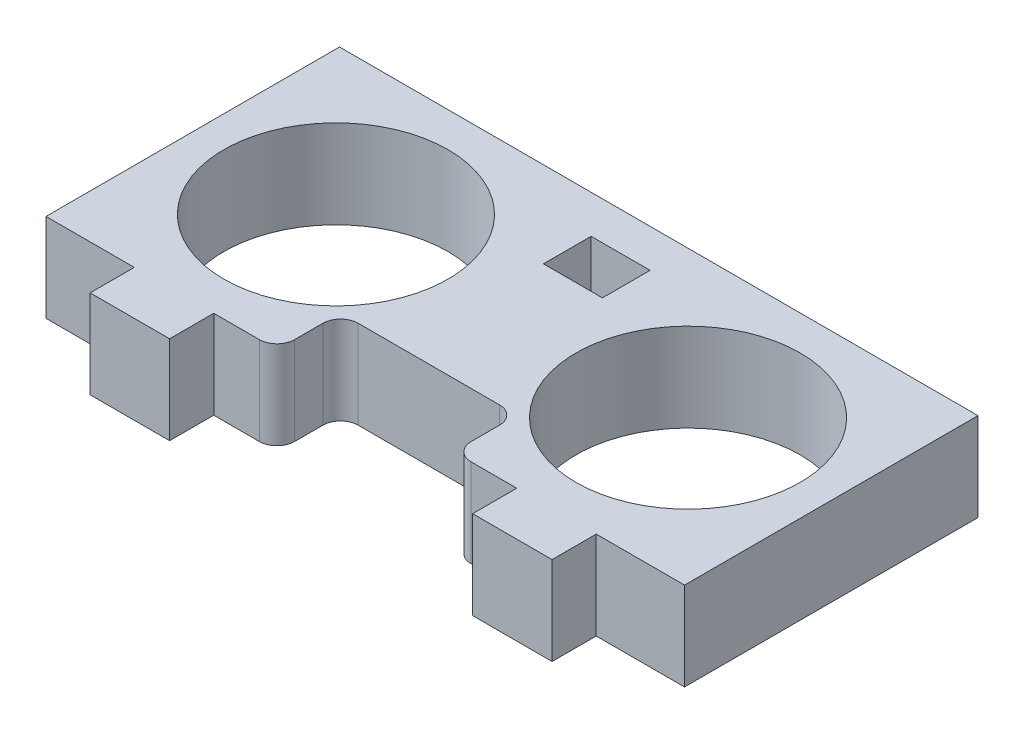
ISO-10303-21;
HEADER;
FILE_DESCRIPTION(('STEP AP214'),'2;1');
FILE_NAME('part.step','',(''),(''),'','','');
FILE_SCHEMA(('AUTOMOTIVE_DESIGN { 1 0 10303 214 1 1 1 1 }'));
ENDSEC;
DATA;
#1=APPLICATION_CONTEXT('core data for automotive mechanical design processes');
#2=APPLICATION_PROTOCOL_DEFINITION('international standard','automotive_design',2000,#1);
#3=PRODUCT_CONTEXT('',#1,'mechanical');
#4=PRODUCT('Part','Part','',(#3));
#5=PRODUCT_RELATED_PRODUCT_CATEGORY('part','',(#4));
#6=PRODUCT_DEFINITION_FORMATION('','',#4);
#7=PRODUCT_DEFINITION_CONTEXT('part definition',#1,'design');
#8=PRODUCT_DEFINITION('design','',#6,#7);
#9=PRODUCT_DEFINITION_SHAPE('','',#8);
#10=(LENGTH_UNIT() NAMED_UNIT(*) SI_UNIT(.MILLI.,.METRE.));
#11=(NAMED_UNIT(*) PLANE_ANGLE_UNIT() SI_UNIT($,.RADIAN.));
#12=(NAMED_UNIT(*) SI_UNIT($,.STERADIAN.) SOLID_ANGLE_UNIT());
#13=UNCERTAINTY_MEASURE_WITH_UNIT(LENGTH_MEASURE(1.E-05),#10,'distance_accuracy_value','');
#14=(GEOMETRIC_REPRESENTATION_CONTEXT(3) GLOBAL_UNCERTAINTY_ASSIGNED_CONTEXT((#13)) GLOBAL_UNIT_ASSIGNED_CONTEXT((#10,
#11,#12)) REPRESENTATION_CONTEXT('',''));
#15=CARTESIAN_POINT('',(0.,0.,0.));
#16=DIRECTION('',(0.,0.,1.));
#17=DIRECTION('',(1.,0.,0.));
#18=AXIS2_PLACEMENT_3D('',#15,#16,#17);
#19=CARTESIAN_POINT('',(-22.9616,6.35,10.5537));
#20=DIRECTION('',(0.,0.,-1.));
#21=DIRECTION('',(-1.,0.,0.));
#22=AXIS2_PLACEMENT_3D('',#19,#20,#21);
#23=PLANE('',#22);
#24=DIRECTION('',(1.,0.,0.));
#25=VECTOR('',#24,1.);
#26=CARTESIAN_POINT('',(-22.9616,6.35,10.5537));
#27=LINE('',#26,#25);
#28=CARTESIAN_POINT('',(7.61999999999999,6.35,10.5537));
#29=VERTEX_POINT('',#28);
#30=CARTESIAN_POINT('',(10.8966,6.35,10.5537));
#31=VERTEX_POINT('',#30);
#32=EDGE_CURVE('E220',#29,#31,#27,.T.);
#33=ORIENTED_EDGE('',*,*,#32,.F.);
#34=DIRECTION('',(0.,1.,0.));
#35=VECTOR('',#34,1.);
#36=CARTESIAN_POINT('',(7.62,6.35,10.5537));
#37=LINE('',#36,#35);
#38=CARTESIAN_POINT('',(7.61999999999999,0.,10.5537));
#39=VERTEX_POINT('',#38);
#40=EDGE_CURVE('E364',#29,#39,#37,.F.);
#41=ORIENTED_EDGE('',*,*,#40,.T.);
#42=DIRECTION('',(1.,0.,0.));
#43=VECTOR('',#42,1.);
#44=CARTESIAN_POINT('',(-22.9616,0.,10.5537));
#45=LINE('',#44,#43);
#46=CARTESIAN_POINT('',(10.8966,0.,10.5537));
#47=VERTEX_POINT('',#46);
#48=EDGE_CURVE('E343',#39,#47,#45,.T.);
#49=ORIENTED_EDGE('',*,*,#48,.T.);
#50=DIRECTION('',(0.,1.,0.));
#51=VECTOR('',#50,1.);
#52=CARTESIAN_POINT('',(10.8966,-6.53772513952675,10.5537));
#53=LINE('',#52,#51);
#54=EDGE_CURVE('E227',#47,#31,#53,.T.);
#55=ORIENTED_EDGE('',*,*,#54,.T.);
#56=EDGE_LOOP('',(#33,#41,#49,#55));
#57=FACE_BOUND('',#56,.T.);
#58=ADVANCED_FACE('F33',(#57),#23,.F.);
#59=CARTESIAN_POINT('',(-22.9616,0.,10.5537));
#60=VERTEX_POINT('',#59);
#61=CARTESIAN_POINT('',(-16.6116,0.,10.5537));
#62=VERTEX_POINT('',#61);
#63=EDGE_CURVE('E324',#60,#62,#45,.T.);
#64=ORIENTED_EDGE('',*,*,#63,.T.);
#65=DIRECTION('',(0.,1.,0.));
#66=VECTOR('',#65,1.);
#67=CARTESIAN_POINT('',(-16.6116,-6.53772513952675,10.5537));
#68=LINE('',#67,#66);
#69=CARTESIAN_POINT('',(-16.6116,6.35,10.5537));
#70=VERTEX_POINT('',#69);
#71=EDGE_CURVE('E240',#62,#70,#68,.T.);
#72=ORIENTED_EDGE('',*,*,#71,.T.);
#73=CARTESIAN_POINT('',(-22.9616,6.35,10.5537));
#74=VERTEX_POINT('',#73);
#75=EDGE_CURVE('E329',#74,#70,#27,.T.);
#76=ORIENTED_EDGE('',*,*,#75,.F.);
#77=DIRECTION('',(0.,-1.,0.));
#78=VECTOR('',#77,1.);
#79=CARTESIAN_POINT('',(-22.9616,6.35,10.5537));
#80=LINE('',#79,#78);
#81=EDGE_CURVE('E346',#74,#60,#80,.T.);
#82=ORIENTED_EDGE('',*,*,#81,.T.);
#83=EDGE_LOOP('',(#64,#72,#76,#82));
#84=FACE_BOUND('',#83,.T.);
#85=ADVANCED_FACE('F447',(#84),#23,.F.);
#86=CARTESIAN_POINT('',(-10.8966,0.,10.5537));
#87=VERTEX_POINT('',#86);
#88=CARTESIAN_POINT('',(-7.62,0.,10.5537));
#89=VERTEX_POINT('',#88);
#90=EDGE_CURVE('E342',#87,#89,#45,.T.);
#91=ORIENTED_EDGE('',*,*,#90,.T.);
#92=DIRECTION('',(0.,1.,0.));
#93=VECTOR('',#92,1.);
#94=CARTESIAN_POINT('',(-7.62,6.35,10.5537));
#95=LINE('',#94,#93);
#96=CARTESIAN_POINT('',(-7.62,6.35,10.5537));
#97=VERTEX_POINT('',#96);
#98=EDGE_CURVE('E369',#89,#97,#95,.T.);
#99=ORIENTED_EDGE('',*,*,#98,.T.);
#100=CARTESIAN_POINT('',(-10.8966,6.35,10.5537));
#101=VERTEX_POINT('',#100);
#102=EDGE_CURVE('E333',#101,#97,#27,.T.);
#103=ORIENTED_EDGE('',*,*,#102,.F.);
#104=DIRECTION('',(0.,1.,0.));
#105=VECTOR('',#104,1.);
#106=CARTESIAN_POINT('',(-10.8966,-6.53772513952675,10.5537));
#107=LINE('',#106,#105);
#108=EDGE_CURVE('E254',#87,#101,#107,.T.);
#109=ORIENTED_EDGE('',*,*,#108,.F.);
#110=EDGE_LOOP('',(#91,#99,#103,#109));
#111=FACE_BOUND('',#110,.T.);
#112=ADVANCED_FACE('F411',(#111),#23,.F.);
#113=CARTESIAN_POINT('',(0.,6.35,0.));
#114=DIRECTION('',(0.,1.,0.));
#115=DIRECTION('',(0.,0.,1.));
#116=AXIS2_PLACEMENT_3D('',#113,#114,#115);
#117=PLANE('',#116);
#118=DIRECTION('',(0.,0.,-1.));
#119=VECTOR('',#118,1.);
#120=CARTESIAN_POINT('',(6.35,6.35,10.5537));
#121=LINE('',#120,#119);
#122=CARTESIAN_POINT('',(6.35,6.35,9.28369999999999));
#123=VERTEX_POINT('',#122);
#124=CARTESIAN_POINT('',(6.35,6.35,7.25169999999999));
#125=VERTEX_POINT('',#124);
#126=EDGE_CURVE('E274',#123,#125,#121,.T.);
#127=ORIENTED_EDGE('',*,*,#126,.F.);
#128=CARTESIAN_POINT('',(7.62,6.35,9.28369999999999));
#129=DIRECTION('',(0.,1.,0.));
#130=DIRECTION('',(0.,0.,1.));
#131=AXIS2_PLACEMENT_3D('',#128,#129,#130);
#132=CIRCLE('',#131,1.27);
#133=EDGE_CURVE('E362',#123,#29,#132,.T.);
#134=ORIENTED_EDGE('',*,*,#133,.T.);
#135=ORIENTED_EDGE('',*,*,#32,.T.);
#136=DIRECTION('',(0.,0.,1.));
#137=VECTOR('',#136,1.);
#138=CARTESIAN_POINT('',(10.8966,6.35,10.5537));
#139=LINE('',#138,#137);
#140=CARTESIAN_POINT('',(10.8966,6.35,13.7287));
#141=VERTEX_POINT('',#140);
#142=EDGE_CURVE('E200',#31,#141,#139,.T.);
#143=ORIENTED_EDGE('',*,*,#142,.T.);
#144=DIRECTION('',(1.,0.,0.));
#145=VECTOR('',#144,1.);
#146=CARTESIAN_POINT('',(10.8966,6.35,13.7287));
#147=LINE('',#146,#145);
#148=CARTESIAN_POINT('',(16.6116,6.35,13.7287));
#149=VERTEX_POINT('',#148);
#150=EDGE_CURVE('E209',#141,#149,#147,.T.);
#151=ORIENTED_EDGE('',*,*,#150,.T.);
#152=DIRECTION('',(0.,0.,-1.));
#153=VECTOR('',#152,1.);
#154=CARTESIAN_POINT('',(16.6116,6.35,10.5537));
#155=LINE('',#154,#153);
#156=CARTESIAN_POINT('',(16.6116,6.35,10.5537));
#157=VERTEX_POINT('',#156);
#158=EDGE_CURVE('E206',#149,#157,#155,.T.);
#159=ORIENTED_EDGE('',*,*,#158,.T.);
#160=CARTESIAN_POINT('',(22.9616,6.35,10.5537));
#161=VERTEX_POINT('',#160);
#162=EDGE_CURVE('E328',#157,#161,#27,.T.);
#163=ORIENTED_EDGE('',*,*,#162,.T.);
#164=DIRECTION('',(0.,0.,-1.));
#165=VECTOR('',#164,1.);
#166=CARTESIAN_POINT('',(22.9616,6.35,-10.5537));
#167=LINE('',#166,#165);
#168=CARTESIAN_POINT('',(22.9616,6.35,-10.5537));
#169=VERTEX_POINT('',#168);
#170=EDGE_CURVE('E320',#161,#169,#167,.T.);
#171=ORIENTED_EDGE('',*,*,#170,.T.);
#172=DIRECTION('',(-1.,0.,0.));
#173=VECTOR('',#172,1.);
#174=CARTESIAN_POINT('',(-22.9616,6.35,-10.5537));
#175=LINE('',#174,#173);
#176=CARTESIAN_POINT('',(-22.9616,6.35,-10.5537));
#177=VERTEX_POINT('',#176);
#178=EDGE_CURVE('E323',#169,#177,#175,.T.);
#179=ORIENTED_EDGE('',*,*,#178,.T.);
#180=DIRECTION('',(0.,0.,1.));
#181=VECTOR('',#180,1.);
#182=CARTESIAN_POINT('',(-22.9616,6.35,-10.5537));
#183=LINE('',#182,#181);
#184=EDGE_CURVE('E326',#177,#74,#183,.T.);
#185=ORIENTED_EDGE('',*,*,#184,.T.);
#186=ORIENTED_EDGE('',*,*,#75,.T.);
#187=DIRECTION('',(0.,0.,1.));
#188=VECTOR('',#187,1.);
#189=CARTESIAN_POINT('',(-16.6116,6.35,10.5537));
#190=LINE('',#189,#188);
#191=CARTESIAN_POINT('',(-16.6116,6.35,13.7287));
#192=VERTEX_POINT('',#191);
#193=EDGE_CURVE('E236',#70,#192,#190,.T.);
#194=ORIENTED_EDGE('',*,*,#193,.T.);
#195=DIRECTION('',(1.,0.,0.));
#196=VECTOR('',#195,1.);
#197=CARTESIAN_POINT('',(-16.6116,6.35,13.7287));
#198=LINE('',#197,#196);
#199=CARTESIAN_POINT('',(-10.8966,6.35,13.7287));
#200=VERTEX_POINT('',#199);
#201=EDGE_CURVE('E246',#192,#200,#198,.T.);
#202=ORIENTED_EDGE('',*,*,#201,.T.);
#203=DIRECTION('',(0.,0.,-1.));
#204=VECTOR('',#203,1.);
#205=CARTESIAN_POINT('',(-10.8966,6.35,10.5537));
#206=LINE('',#205,#204);
#207=EDGE_CURVE('E249',#200,#101,#206,.T.);
#208=ORIENTED_EDGE('',*,*,#207,.T.);
#209=ORIENTED_EDGE('',*,*,#102,.T.);
#210=CARTESIAN_POINT('',(-7.62,6.35,9.28369999999999));
#211=DIRECTION('',(0.,1.,0.));
#212=DIRECTION('',(0.,0.,1.));
#213=AXIS2_PLACEMENT_3D('',#210,#211,#212);
#214=CIRCLE('',#213,1.27);
#215=CARTESIAN_POINT('',(-6.35,6.35,9.28369999999999));
#216=VERTEX_POINT('',#215);
#217=EDGE_CURVE('E360',#97,#216,#214,.T.);
#218=ORIENTED_EDGE('',*,*,#217,.T.);
#219=DIRECTION('',(0.,0.,1.));
#220=VECTOR('',#219,1.);
#221=CARTESIAN_POINT('',(-6.35,6.35,10.5537));
#222=LINE('',#221,#220);
#223=CARTESIAN_POINT('',(-6.35,6.35,7.25169999999999));
#224=VERTEX_POINT('',#223);
#225=EDGE_CURVE('E261',#224,#216,#222,.T.);
#226=ORIENTED_EDGE('',*,*,#225,.F.);
#227=CARTESIAN_POINT('',(-5.08,6.35,7.25169999999999));
#228=DIRECTION('',(0.,1.,0.));
#229=DIRECTION('',(0.,0.,1.));
#230=AXIS2_PLACEMENT_3D('',#227,#228,#229);
#231=CIRCLE('',#230,1.27);
#232=CARTESIAN_POINT('',(-5.08,6.35,5.98169999999999));
#233=VERTEX_POINT('',#232);
#234=EDGE_CURVE('E382',#224,#233,#231,.F.);
#235=ORIENTED_EDGE('',*,*,#234,.T.);
#236=DIRECTION('',(-1.,0.,0.));
#237=VECTOR('',#236,1.);
#238=CARTESIAN_POINT('',(-6.35,6.35,5.98169999999999));
#239=LINE('',#238,#237);
#240=CARTESIAN_POINT('',(5.08,6.35,5.98169999999999));
#241=VERTEX_POINT('',#240);
#242=EDGE_CURVE('E266',#241,#233,#239,.T.);
#243=ORIENTED_EDGE('',*,*,#242,.F.);
#244=CARTESIAN_POINT('',(5.08,6.35,7.25169999999999));
#245=DIRECTION('',(0.,1.,0.));
#246=DIRECTION('',(0.,0.,1.));
#247=AXIS2_PLACEMENT_3D('',#244,#245,#246);
#248=CIRCLE('',#247,1.27);
#249=EDGE_CURVE('E41',#241,#125,#248,.F.);
#250=ORIENTED_EDGE('',*,*,#249,.T.);
#251=EDGE_LOOP('',(#127,#134,#135,#143,#151,#159,#163,#171,#179,#185,#186,#194,#202,#208,#209,
#218,#226,#235,#243,#250));
#252=FACE_BOUND('',#251,.T.);
#253=DIRECTION('',(0.,0.,-1.));
#254=VECTOR('',#253,1.);
#255=CARTESIAN_POINT('',(2.1209,6.35,-7.8105));
#256=LINE('',#255,#254);
#257=CARTESIAN_POINT('',(2.1209,6.35,-4.38150000000001));
#258=VERTEX_POINT('',#257);
#259=CARTESIAN_POINT('',(2.1209,6.35,-7.8105));
#260=VERTEX_POINT('',#259);
#261=EDGE_CURVE('E271',#258,#260,#256,.T.);
#262=ORIENTED_EDGE('',*,*,#261,.F.);
#263=DIRECTION('',(1.,0.,0.));
#264=VECTOR('',#263,1.);
#265=CARTESIAN_POINT('',(-2.1209,6.35,-4.38150000000001));
#266=LINE('',#265,#264);
#267=CARTESIAN_POINT('',(-2.1209,6.35,-4.38150000000001));
#268=VERTEX_POINT('',#267);
#269=EDGE_CURVE('E295',#268,#258,#266,.T.);
#270=ORIENTED_EDGE('',*,*,#269,.F.);
#271=DIRECTION('',(0.,0.,1.));
#272=VECTOR('',#271,1.);
#273=CARTESIAN_POINT('',(-2.1209,6.35,-7.8105));
#274=LINE('',#273,#272);
#275=CARTESIAN_POINT('',(-2.1209,6.35,-7.8105));
#276=VERTEX_POINT('',#275);
#277=EDGE_CURVE('E292',#276,#268,#274,.T.);
#278=ORIENTED_EDGE('',*,*,#277,.F.);
#279=DIRECTION('',(-1.,0.,0.));
#280=VECTOR('',#279,1.);
#281=CARTESIAN_POINT('',(-2.1209,6.35,-7.8105));
#282=LINE('',#281,#280);
#283=EDGE_CURVE('E289',#260,#276,#282,.T.);
#284=ORIENTED_EDGE('',*,*,#283,.F.);
#285=EDGE_LOOP('',(#262,#270,#278,#284));
#286=FACE_BOUND('',#285,.T.);
#287=CARTESIAN_POINT('',(-12.6619,6.35,0.));
#288=DIRECTION('',(0.,1.,0.));
#289=DIRECTION('',(0.,0.,1.));
#290=AXIS2_PLACEMENT_3D('',#287,#288,#289);
#291=CIRCLE('',#290,8.0645);
#292=CARTESIAN_POINT('',(-12.6619,6.35,8.0645));
#293=VERTEX_POINT('',#292);
#294=EDGE_CURVE('E314',#293,#293,#291,.T.);
#295=ORIENTED_EDGE('',*,*,#294,.F.);
#296=EDGE_LOOP('',(#295));
#297=FACE_BOUND('',#296,.T.);
#298=CARTESIAN_POINT('',(12.6619,6.35,0.));
#299=DIRECTION('',(0.,1.,0.));
#300=DIRECTION('',(0.,0.,1.));
#301=AXIS2_PLACEMENT_3D('',#298,#299,#300);
#302=CIRCLE('',#301,8.0645);
#303=CARTESIAN_POINT('',(12.6619,6.35,8.0645));
#304=VERTEX_POINT('',#303);
#305=EDGE_CURVE('E308',#304,#304,#302,.T.);
#306=ORIENTED_EDGE('',*,*,#305,.F.);
#307=EDGE_LOOP('',(#306));
#308=FACE_BOUND('',#307,.T.);
#309=ADVANCED_FACE('F217',(#252,#286,#297,#308),#117,.T.);
#310=CARTESIAN_POINT('',(0.,0.,0.));
#311=DIRECTION('',(0.,1.,0.));
#312=DIRECTION('',(0.,0.,1.));
#313=AXIS2_PLACEMENT_3D('',#310,#311,#312);
#314=PLANE('',#313);
#315=DIRECTION('',(-1.,0.,0.));
#316=VECTOR('',#315,1.);
#317=CARTESIAN_POINT('',(-2.1209,0.,-4.38150000000001));
#318=LINE('',#317,#316);
#319=CARTESIAN_POINT('',(2.1209,0.,-4.38150000000001));
#320=VERTEX_POINT('',#319);
#321=CARTESIAN_POINT('',(-2.1209,0.,-4.38150000000001));
#322=VERTEX_POINT('',#321);
#323=EDGE_CURVE('E282',#320,#322,#318,.T.);
#324=ORIENTED_EDGE('',*,*,#323,.F.);
#325=DIRECTION('',(0.,0.,1.));
#326=VECTOR('',#325,1.);
#327=CARTESIAN_POINT('',(2.1209,0.,-7.8105));
#328=LINE('',#327,#326);
#329=CARTESIAN_POINT('',(2.1209,0.,-7.8105));
#330=VERTEX_POINT('',#329);
#331=EDGE_CURVE('E285',#330,#320,#328,.T.);
#332=ORIENTED_EDGE('',*,*,#331,.F.);
#333=DIRECTION('',(1.,0.,0.));
#334=VECTOR('',#333,1.);
#335=CARTESIAN_POINT('',(-2.1209,0.,-7.8105));
#336=LINE('',#335,#334);
#337=CARTESIAN_POINT('',(-2.1209,0.,-7.8105));
#338=VERTEX_POINT('',#337);
#339=EDGE_CURVE('E287',#338,#330,#336,.T.);
#340=ORIENTED_EDGE('',*,*,#339,.F.);
#341=DIRECTION('',(0.,0.,-1.));
#342=VECTOR('',#341,1.);
#343=CARTESIAN_POINT('',(-2.1209,0.,-7.8105));
#344=LINE('',#343,#342);
#345=EDGE_CURVE('E279',#322,#338,#344,.T.);
#346=ORIENTED_EDGE('',*,*,#345,.F.);
#347=EDGE_LOOP('',(#324,#332,#340,#346));
#348=FACE_BOUND('',#347,.T.);
#349=CARTESIAN_POINT('',(-12.6619,0.,0.));
#350=DIRECTION('',(0.,1.,0.));
#351=DIRECTION('',(0.,0.,1.));
#352=AXIS2_PLACEMENT_3D('',#349,#350,#351);
#353=CIRCLE('',#352,8.0645);
#354=CARTESIAN_POINT('',(-12.6619,0.,8.0645));
#355=VERTEX_POINT('',#354);
#356=EDGE_CURVE('E311',#355,#355,#353,.T.);
#357=ORIENTED_EDGE('',*,*,#356,.T.);
#358=EDGE_LOOP('',(#357));
#359=FACE_BOUND('',#358,.T.);
#360=ORIENTED_EDGE('',*,*,#48,.F.);
#361=CARTESIAN_POINT('',(7.62,0.,9.28369999999999));
#362=DIRECTION('',(0.,1.,0.));
#363=DIRECTION('',(0.,0.,1.));
#364=AXIS2_PLACEMENT_3D('',#361,#362,#363);
#365=CIRCLE('',#364,1.27);
#366=CARTESIAN_POINT('',(6.35,0.,9.28369999999999));
#367=VERTEX_POINT('',#366);
#368=EDGE_CURVE('E367',#39,#367,#365,.F.);
#369=ORIENTED_EDGE('',*,*,#368,.T.);
#370=DIRECTION('',(0.,0.,1.));
#371=VECTOR('',#370,1.);
#372=CARTESIAN_POINT('',(6.35,0.,10.5537));
#373=LINE('',#372,#371);
#374=CARTESIAN_POINT('',(6.35,0.,7.25169999999999));
#375=VERTEX_POINT('',#374);
#376=EDGE_CURVE('E262',#375,#367,#373,.T.);
#377=ORIENTED_EDGE('',*,*,#376,.F.);
#378=CARTESIAN_POINT('',(5.08,0.,7.25169999999999));
#379=DIRECTION('',(0.,1.,0.));
#380=DIRECTION('',(0.,0.,1.));
#381=AXIS2_PLACEMENT_3D('',#378,#379,#380);
#382=CIRCLE('',#381,1.27);
#383=CARTESIAN_POINT('',(5.08,0.,5.98169999999999));
#384=VERTEX_POINT('',#383);
#385=EDGE_CURVE('E11',#375,#384,#382,.T.);
#386=ORIENTED_EDGE('',*,*,#385,.T.);
#387=DIRECTION('',(1.,0.,0.));
#388=VECTOR('',#387,1.);
#389=CARTESIAN_POINT('',(-6.35,0.,5.98169999999999));
#390=LINE('',#389,#388);
#391=CARTESIAN_POINT('',(-5.08,0.,5.98169999999999));
#392=VERTEX_POINT('',#391);
#393=EDGE_CURVE('E265',#392,#384,#390,.T.);
#394=ORIENTED_EDGE('',*,*,#393,.F.);
#395=CARTESIAN_POINT('',(-5.08,0.,7.25169999999999));
#396=DIRECTION('',(0.,1.,0.));
#397=DIRECTION('',(0.,0.,1.));
#398=AXIS2_PLACEMENT_3D('',#395,#396,#397);
#399=CIRCLE('',#398,1.27);
#400=CARTESIAN_POINT('',(-6.35,0.,7.25169999999999));
#401=VERTEX_POINT('',#400);
#402=EDGE_CURVE('E54',#392,#401,#399,.T.);
#403=ORIENTED_EDGE('',*,*,#402,.T.);
#404=DIRECTION('',(0.,0.,-1.));
#405=VECTOR('',#404,1.);
#406=CARTESIAN_POINT('',(-6.35,0.,10.5537));
#407=LINE('',#406,#405);
#408=CARTESIAN_POINT('',(-6.35,0.,9.28369999999999));
#409=VERTEX_POINT('',#408);
#410=EDGE_CURVE('E269',#409,#401,#407,.T.);
#411=ORIENTED_EDGE('',*,*,#410,.F.);
#412=CARTESIAN_POINT('',(-7.62,0.,9.28369999999999));
#413=DIRECTION('',(0.,1.,0.));
#414=DIRECTION('',(0.,0.,1.));
#415=AXIS2_PLACEMENT_3D('',#412,#413,#414);
#416=CIRCLE('',#415,1.27);
#417=EDGE_CURVE('E48',#409,#89,#416,.F.);
#418=ORIENTED_EDGE('',*,*,#417,.T.);
#419=ORIENTED_EDGE('',*,*,#90,.F.);
#420=DIRECTION('',(0.,0.,1.));
#421=VECTOR('',#420,1.);
#422=CARTESIAN_POINT('',(-10.8966,0.,10.5537));
#423=LINE('',#422,#421);
#424=CARTESIAN_POINT('',(-10.8966,0.,13.7287));
#425=VERTEX_POINT('',#424);
#426=EDGE_CURVE('E237',#87,#425,#423,.T.);
#427=ORIENTED_EDGE('',*,*,#426,.T.);
#428=DIRECTION('',(-1.,0.,0.));
#429=VECTOR('',#428,1.);
#430=CARTESIAN_POINT('',(-16.6116,0.,13.7287));
#431=LINE('',#430,#429);
#432=CARTESIAN_POINT('',(-16.6116,0.,13.7287));
#433=VERTEX_POINT('',#432);
#434=EDGE_CURVE('E243',#425,#433,#431,.T.);
#435=ORIENTED_EDGE('',*,*,#434,.T.);
#436=DIRECTION('',(0.,0.,-1.));
#437=VECTOR('',#436,1.);
#438=CARTESIAN_POINT('',(-16.6116,0.,10.5537));
#439=LINE('',#438,#437);
#440=EDGE_CURVE('E239',#433,#62,#439,.T.);
#441=ORIENTED_EDGE('',*,*,#440,.T.);
#442=ORIENTED_EDGE('',*,*,#63,.F.);
#443=DIRECTION('',(0.,0.,1.));
#444=VECTOR('',#443,1.);
#445=CARTESIAN_POINT('',(-22.9616,0.,-10.5537));
#446=LINE('',#445,#444);
#447=CARTESIAN_POINT('',(-22.9616,0.,-10.5537));
#448=VERTEX_POINT('',#447);
#449=EDGE_CURVE('E338',#448,#60,#446,.T.);
#450=ORIENTED_EDGE('',*,*,#449,.F.);
#451=DIRECTION('',(-1.,0.,0.));
#452=VECTOR('',#451,1.);
#453=CARTESIAN_POINT('',(-22.9616,0.,-10.5537));
#454=LINE('',#453,#452);
#455=CARTESIAN_POINT('',(22.9616,0.,-10.5537));
#456=VERTEX_POINT('',#455);
#457=EDGE_CURVE('E336',#456,#448,#454,.T.);
#458=ORIENTED_EDGE('',*,*,#457,.F.);
#459=DIRECTION('',(0.,0.,-1.));
#460=VECTOR('',#459,1.);
#461=CARTESIAN_POINT('',(22.9616,0.,-10.5537));
#462=LINE('',#461,#460);
#463=CARTESIAN_POINT('',(22.9616,0.,10.5537));
#464=VERTEX_POINT('',#463);
#465=EDGE_CURVE('E317',#464,#456,#462,.T.);
#466=ORIENTED_EDGE('',*,*,#465,.F.);
#467=CARTESIAN_POINT('',(16.6116,0.,10.5537));
#468=VERTEX_POINT('',#467);
#469=EDGE_CURVE('E340',#468,#464,#45,.T.);
#470=ORIENTED_EDGE('',*,*,#469,.F.);
#471=DIRECTION('',(0.,0.,1.));
#472=VECTOR('',#471,1.);
#473=CARTESIAN_POINT('',(16.6116,0.,10.5537));
#474=LINE('',#473,#472);
#475=CARTESIAN_POINT('',(16.6116,0.,13.7287));
#476=VERTEX_POINT('',#475);
#477=EDGE_CURVE('E229',#468,#476,#474,.T.);
#478=ORIENTED_EDGE('',*,*,#477,.T.);
#479=DIRECTION('',(-1.,0.,0.));
#480=VECTOR('',#479,1.);
#481=CARTESIAN_POINT('',(10.8966,0.,13.7287));
#482=LINE('',#481,#480);
#483=CARTESIAN_POINT('',(10.8966,0.,13.7287));
#484=VERTEX_POINT('',#483);
#485=EDGE_CURVE('E234',#476,#484,#482,.T.);
#486=ORIENTED_EDGE('',*,*,#485,.T.);
#487=DIRECTION('',(0.,0.,-1.));
#488=VECTOR('',#487,1.);
#489=CARTESIAN_POINT('',(10.8966,0.,10.5537));
#490=LINE('',#489,#488);
#491=EDGE_CURVE('E202',#484,#47,#490,.T.);
#492=ORIENTED_EDGE('',*,*,#491,.T.);
#493=EDGE_LOOP('',(#360,#369,#377,#386,#394,#403,#411,#418,#419,#427,#435,#441,#442,#450,#458,
#466,#470,#478,#486,#492));
#494=FACE_BOUND('',#493,.T.);
#495=CARTESIAN_POINT('',(12.6619,0.,0.));
#496=DIRECTION('',(0.,1.,0.));
#497=DIRECTION('',(0.,0.,1.));
#498=AXIS2_PLACEMENT_3D('',#495,#496,#497);
#499=CIRCLE('',#498,8.0645);
#500=CARTESIAN_POINT('',(12.6619,0.,8.0645));
#501=VERTEX_POINT('',#500);
#502=EDGE_CURVE('E307',#501,#501,#499,.T.);
#503=ORIENTED_EDGE('',*,*,#502,.T.);
#504=EDGE_LOOP('',(#503));
#505=FACE_BOUND('',#504,.T.);
#506=ADVANCED_FACE('F394',(#348,#359,#494,#505),#314,.F.);
#507=CARTESIAN_POINT('',(22.9616,6.35,-10.5537));
#508=DIRECTION('',(-1.,0.,0.));
#509=DIRECTION('',(0.,0.,1.));
#510=AXIS2_PLACEMENT_3D('',#507,#508,#509);
#511=PLANE('',#510);
#512=ORIENTED_EDGE('',*,*,#465,.T.);
#513=DIRECTION('',(0.,-1.,0.));
#514=VECTOR('',#513,1.);
#515=CARTESIAN_POINT('',(22.9616,6.35,-10.5537));
#516=LINE('',#515,#514);
#517=EDGE_CURVE('E352',#169,#456,#516,.T.);
#518=ORIENTED_EDGE('',*,*,#517,.F.);
#519=ORIENTED_EDGE('',*,*,#170,.F.);
#520=DIRECTION('',(0.,-1.,0.));
#521=VECTOR('',#520,1.);
#522=CARTESIAN_POINT('',(22.9616,6.35,10.5537));
#523=LINE('',#522,#521);
#524=EDGE_CURVE('E332',#161,#464,#523,.T.);
#525=ORIENTED_EDGE('',*,*,#524,.T.);
#526=EDGE_LOOP('',(#512,#518,#519,#525));
#527=FACE_BOUND('',#526,.T.);
#528=ADVANCED_FACE('F422',(#527),#511,.F.);
#529=CARTESIAN_POINT('',(-22.9616,6.35,-10.5537));
#530=DIRECTION('',(0.,0.,1.));
#531=DIRECTION('',(1.,0.,0.));
#532=AXIS2_PLACEMENT_3D('',#529,#530,#531);
#533=PLANE('',#532);
#534=ORIENTED_EDGE('',*,*,#457,.T.);
#535=DIRECTION('',(0.,-1.,0.));
#536=VECTOR('',#535,1.);
#537=CARTESIAN_POINT('',(-22.9616,6.35,-10.5537));
#538=LINE('',#537,#536);
#539=EDGE_CURVE('E349',#177,#448,#538,.T.);
#540=ORIENTED_EDGE('',*,*,#539,.F.);
#541=ORIENTED_EDGE('',*,*,#178,.F.);
#542=ORIENTED_EDGE('',*,*,#517,.T.);
#543=EDGE_LOOP('',(#534,#540,#541,#542));
#544=FACE_BOUND('',#543,.T.);
#545=ADVANCED_FACE('F428',(#544),#533,.F.);
#546=CARTESIAN_POINT('',(-22.9616,6.35,-10.5537));
#547=DIRECTION('',(1.,0.,0.));
#548=DIRECTION('',(0.,0.,-1.));
#549=AXIS2_PLACEMENT_3D('',#546,#547,#548);
#550=PLANE('',#549);
#551=ORIENTED_EDGE('',*,*,#449,.T.);
#552=ORIENTED_EDGE('',*,*,#81,.F.);
#553=ORIENTED_EDGE('',*,*,#184,.F.);
#554=ORIENTED_EDGE('',*,*,#539,.T.);
#555=EDGE_LOOP('',(#551,#552,#553,#554));
#556=FACE_BOUND('',#555,.T.);
#557=ADVANCED_FACE('F457',(#556),#550,.F.);
#558=ORIENTED_EDGE('',*,*,#162,.F.);
#559=DIRECTION('',(0.,1.,0.));
#560=VECTOR('',#559,1.);
#561=CARTESIAN_POINT('',(16.6116,-6.53772513952675,10.5537));
#562=LINE('',#561,#560);
#563=EDGE_CURVE('E230',#468,#157,#562,.T.);
#564=ORIENTED_EDGE('',*,*,#563,.F.);
#565=ORIENTED_EDGE('',*,*,#469,.T.);
#566=ORIENTED_EDGE('',*,*,#524,.F.);
#567=EDGE_LOOP('',(#558,#564,#565,#566));
#568=FACE_BOUND('',#567,.T.);
#569=ADVANCED_FACE('F417',(#568),#23,.F.);
#570=CARTESIAN_POINT('',(-12.6619,6.35,0.));
#571=DIRECTION('',(0.,-1.,0.));
#572=DIRECTION('',(0.,0.,-1.));
#573=AXIS2_PLACEMENT_3D('',#570,#571,#572);
#574=CYLINDRICAL_SURFACE('',#573,8.0645);
#575=ORIENTED_EDGE('',*,*,#294,.T.);
#576=EDGE_LOOP('',(#575));
#577=FACE_BOUND('',#576,.T.);
#578=ORIENTED_EDGE('',*,*,#356,.F.);
#579=EDGE_LOOP('',(#578));
#580=FACE_BOUND('',#579,.T.);
#581=ADVANCED_FACE('F456',(#577,#580),#574,.F.);
#582=CARTESIAN_POINT('',(12.6619,6.35,0.));
#583=DIRECTION('',(0.,-1.,0.));
#584=DIRECTION('',(0.,0.,-1.));
#585=AXIS2_PLACEMENT_3D('',#582,#583,#584);
#586=CYLINDRICAL_SURFACE('',#585,8.0645);
#587=ORIENTED_EDGE('',*,*,#305,.T.);
#588=EDGE_LOOP('',(#587));
#589=FACE_BOUND('',#588,.T.);
#590=ORIENTED_EDGE('',*,*,#502,.F.);
#591=EDGE_LOOP('',(#590));
#592=FACE_BOUND('',#591,.T.);
#593=ADVANCED_FACE('F462',(#589,#592),#586,.F.);
#594=CARTESIAN_POINT('',(2.1209,-13.4978955396758,-7.8105));
#595=DIRECTION('',(1.,0.,0.));
#596=DIRECTION('',(0.,0.,-1.));
#597=AXIS2_PLACEMENT_3D('',#594,#595,#596);
#598=PLANE('',#597);
#599=ORIENTED_EDGE('',*,*,#331,.T.);
#600=DIRECTION('',(0.,1.,0.));
#601=VECTOR('',#600,1.);
#602=CARTESIAN_POINT('',(2.1209,-13.4978955396758,-4.38150000000001));
#603=LINE('',#602,#601);
#604=EDGE_CURVE('E283',#320,#258,#603,.T.);
#605=ORIENTED_EDGE('',*,*,#604,.T.);
#606=ORIENTED_EDGE('',*,*,#261,.T.);
#607=DIRECTION('',(0.,1.,0.));
#608=VECTOR('',#607,1.);
#609=CARTESIAN_POINT('',(2.1209,-13.4978955396758,-7.8105));
#610=LINE('',#609,#608);
#611=EDGE_CURVE('E298',#330,#260,#610,.T.);
#612=ORIENTED_EDGE('',*,*,#611,.F.);
#613=EDGE_LOOP('',(#599,#605,#606,#612));
#614=FACE_BOUND('',#613,.T.);
#615=ADVANCED_FACE('F478',(#614),#598,.F.);
#616=CARTESIAN_POINT('',(-2.1209,-13.4978955396758,-4.38150000000001));
#617=DIRECTION('',(0.,0.,1.));
#618=DIRECTION('',(1.,0.,0.));
#619=AXIS2_PLACEMENT_3D('',#616,#617,#618);
#620=PLANE('',#619);
#621=ORIENTED_EDGE('',*,*,#323,.T.);
#622=DIRECTION('',(0.,1.,0.));
#623=VECTOR('',#622,1.);
#624=CARTESIAN_POINT('',(-2.1209,-13.4978955396758,-4.38150000000001));
#625=LINE('',#624,#623);
#626=EDGE_CURVE('E300',#322,#268,#625,.T.);
#627=ORIENTED_EDGE('',*,*,#626,.T.);
#628=ORIENTED_EDGE('',*,*,#269,.T.);
#629=ORIENTED_EDGE('',*,*,#604,.F.);
#630=EDGE_LOOP('',(#621,#627,#628,#629));
#631=FACE_BOUND('',#630,.T.);
#632=ADVANCED_FACE('F482',(#631),#620,.F.);
#633=CARTESIAN_POINT('',(-2.1209,-13.4978955396758,-7.8105));
#634=DIRECTION('',(-1.,0.,0.));
#635=DIRECTION('',(0.,0.,1.));
#636=AXIS2_PLACEMENT_3D('',#633,#634,#635);
#637=PLANE('',#636);
#638=ORIENTED_EDGE('',*,*,#345,.T.);
#639=DIRECTION('',(0.,1.,0.));
#640=VECTOR('',#639,1.);
#641=CARTESIAN_POINT('',(-2.1209,-13.4978955396758,-7.8105));
#642=LINE('',#641,#640);
#643=EDGE_CURVE('E302',#338,#276,#642,.T.);
#644=ORIENTED_EDGE('',*,*,#643,.T.);
#645=ORIENTED_EDGE('',*,*,#277,.T.);
#646=ORIENTED_EDGE('',*,*,#626,.F.);
#647=EDGE_LOOP('',(#638,#644,#645,#646));
#648=FACE_BOUND('',#647,.T.);
#649=ADVANCED_FACE('F487',(#648),#637,.F.);
#650=CARTESIAN_POINT('',(-2.1209,-13.4978955396758,-7.8105));
#651=DIRECTION('',(0.,0.,-1.));
#652=DIRECTION('',(-1.,0.,0.));
#653=AXIS2_PLACEMENT_3D('',#650,#651,#652);
#654=PLANE('',#653);
#655=ORIENTED_EDGE('',*,*,#339,.T.);
#656=ORIENTED_EDGE('',*,*,#611,.T.);
#657=ORIENTED_EDGE('',*,*,#283,.T.);
#658=ORIENTED_EDGE('',*,*,#643,.F.);
#659=EDGE_LOOP('',(#655,#656,#657,#658));
#660=FACE_BOUND('',#659,.T.);
#661=ADVANCED_FACE('F484',(#660),#654,.F.);
#662=CARTESIAN_POINT('',(-6.35,-13.4978955396758,10.5537));
#663=DIRECTION('',(-1.,0.,0.));
#664=DIRECTION('',(0.,0.,1.));
#665=AXIS2_PLACEMENT_3D('',#662,#663,#664);
#666=PLANE('',#665);
#667=ORIENTED_EDGE('',*,*,#225,.T.);
#668=DIRECTION('',(0.,1.,0.));
#669=VECTOR('',#668,1.);
#670=CARTESIAN_POINT('',(-6.35,-13.4978955396758,9.28369999999999));
#671=LINE('',#670,#669);
#672=EDGE_CURVE('E375',#216,#409,#671,.F.);
#673=ORIENTED_EDGE('',*,*,#672,.T.);
#674=ORIENTED_EDGE('',*,*,#410,.T.);
#675=DIRECTION('',(0.,1.,0.));
#676=VECTOR('',#675,1.);
#677=CARTESIAN_POINT('',(-6.35,6.35,7.25169999999999));
#678=LINE('',#677,#676);
#679=EDGE_CURVE('E372',#401,#224,#678,.T.);
#680=ORIENTED_EDGE('',*,*,#679,.T.);
#681=EDGE_LOOP('',(#667,#673,#674,#680));
#682=FACE_BOUND('',#681,.T.);
#683=ADVANCED_FACE('F404',(#682),#666,.F.);
#684=CARTESIAN_POINT('',(-6.35,-13.4978955396758,5.98169999999999));
#685=DIRECTION('',(0.,0.,-1.));
#686=DIRECTION('',(-1.,0.,0.));
#687=AXIS2_PLACEMENT_3D('',#684,#685,#686);
#688=PLANE('',#687);
#689=ORIENTED_EDGE('',*,*,#242,.T.);
#690=DIRECTION('',(0.,1.,0.));
#691=VECTOR('',#690,1.);
#692=CARTESIAN_POINT('',(-5.08,0.,5.98169999999999));
#693=LINE('',#692,#691);
#694=EDGE_CURVE('E380',#233,#392,#693,.F.);
#695=ORIENTED_EDGE('',*,*,#694,.T.);
#696=ORIENTED_EDGE('',*,*,#393,.T.);
#697=DIRECTION('',(0.,1.,0.));
#698=VECTOR('',#697,1.);
#699=CARTESIAN_POINT('',(5.08,6.35,5.98169999999999));
#700=LINE('',#699,#698);
#701=EDGE_CURVE('E377',#384,#241,#700,.T.);
#702=ORIENTED_EDGE('',*,*,#701,.T.);
#703=EDGE_LOOP('',(#689,#695,#696,#702));
#704=FACE_BOUND('',#703,.T.);
#705=ADVANCED_FACE('F397',(#704),#688,.F.);
#706=CARTESIAN_POINT('',(6.35,-13.4978955396758,10.5537));
#707=DIRECTION('',(1.,0.,0.));
#708=DIRECTION('',(0.,0.,-1.));
#709=AXIS2_PLACEMENT_3D('',#706,#707,#708);
#710=PLANE('',#709);
#711=ORIENTED_EDGE('',*,*,#376,.T.);
#712=DIRECTION('',(0.,1.,0.));
#713=VECTOR('',#712,1.);
#714=CARTESIAN_POINT('',(6.35,-13.4978955396758,9.28369999999999));
#715=LINE('',#714,#713);
#716=EDGE_CURVE('E357',#367,#123,#715,.T.);
#717=ORIENTED_EDGE('',*,*,#716,.T.);
#718=ORIENTED_EDGE('',*,*,#126,.T.);
#719=DIRECTION('',(0.,1.,0.));
#720=VECTOR('',#719,1.);
#721=CARTESIAN_POINT('',(6.35,0.,7.25169999999999));
#722=LINE('',#721,#720);
#723=EDGE_CURVE('E355',#125,#375,#722,.F.);
#724=ORIENTED_EDGE('',*,*,#723,.T.);
#725=EDGE_LOOP('',(#711,#717,#718,#724));
#726=FACE_BOUND('',#725,.T.);
#727=ADVANCED_FACE('F389',(#726),#710,.F.);
#728=CARTESIAN_POINT('',(-16.6116,-6.53772513952675,10.5537));
#729=DIRECTION('',(-1.,0.,0.));
#730=DIRECTION('',(0.,0.,1.));
#731=AXIS2_PLACEMENT_3D('',#728,#729,#730);
#732=PLANE('',#731);
#733=ORIENTED_EDGE('',*,*,#440,.F.);
#734=DIRECTION('',(0.,1.,0.));
#735=VECTOR('',#734,1.);
#736=CARTESIAN_POINT('',(-16.6116,-6.53772513952675,13.7287));
#737=LINE('',#736,#735);
#738=EDGE_CURVE('E252',#433,#192,#737,.T.);
#739=ORIENTED_EDGE('',*,*,#738,.T.);
#740=ORIENTED_EDGE('',*,*,#193,.F.);
#741=ORIENTED_EDGE('',*,*,#71,.F.);
#742=EDGE_LOOP('',(#733,#739,#740,#741));
#743=FACE_BOUND('',#742,.T.);
#744=ADVANCED_FACE('F499',(#743),#732,.T.);
#745=CARTESIAN_POINT('',(-10.8966,-6.53772513952675,10.5537));
#746=DIRECTION('',(1.,0.,0.));
#747=DIRECTION('',(0.,0.,-1.));
#748=AXIS2_PLACEMENT_3D('',#745,#746,#747);
#749=PLANE('',#748);
#750=ORIENTED_EDGE('',*,*,#426,.F.);
#751=ORIENTED_EDGE('',*,*,#108,.T.);
#752=ORIENTED_EDGE('',*,*,#207,.F.);
#753=DIRECTION('',(0.,1.,0.));
#754=VECTOR('',#753,1.);
#755=CARTESIAN_POINT('',(-10.8966,-6.53772513952675,13.7287));
#756=LINE('',#755,#754);
#757=EDGE_CURVE('E257',#425,#200,#756,.T.);
#758=ORIENTED_EDGE('',*,*,#757,.F.);
#759=EDGE_LOOP('',(#750,#751,#752,#758));
#760=FACE_BOUND('',#759,.T.);
#761=ADVANCED_FACE('F504',(#760),#749,.T.);
#762=CARTESIAN_POINT('',(-16.6116,-6.53772513952675,13.7287));
#763=DIRECTION('',(0.,0.,1.));
#764=DIRECTION('',(1.,0.,0.));
#765=AXIS2_PLACEMENT_3D('',#762,#763,#764);
#766=PLANE('',#765);
#767=ORIENTED_EDGE('',*,*,#434,.F.);
#768=ORIENTED_EDGE('',*,*,#757,.T.);
#769=ORIENTED_EDGE('',*,*,#201,.F.);
#770=ORIENTED_EDGE('',*,*,#738,.F.);
#771=EDGE_LOOP('',(#767,#768,#769,#770));
#772=FACE_BOUND('',#771,.T.);
#773=ADVANCED_FACE('F506',(#772),#766,.T.);
#774=CARTESIAN_POINT('',(10.8966,-6.53772513952675,10.5537));
#775=DIRECTION('',(-1.,0.,0.));
#776=DIRECTION('',(0.,0.,1.));
#777=AXIS2_PLACEMENT_3D('',#774,#775,#776);
#778=PLANE('',#777);
#779=ORIENTED_EDGE('',*,*,#491,.F.);
#780=DIRECTION('',(0.,1.,0.));
#781=VECTOR('',#780,1.);
#782=CARTESIAN_POINT('',(10.8966,-6.53772513952675,13.7287));
#783=LINE('',#782,#781);
#784=EDGE_CURVE('E195',#484,#141,#783,.T.);
#785=ORIENTED_EDGE('',*,*,#784,.T.);
#786=ORIENTED_EDGE('',*,*,#142,.F.);
#787=ORIENTED_EDGE('',*,*,#54,.F.);
#788=EDGE_LOOP('',(#779,#785,#786,#787));
#789=FACE_BOUND('',#788,.T.);
#790=ADVANCED_FACE('F197',(#789),#778,.T.);
#791=CARTESIAN_POINT('',(16.6116,-6.53772513952675,10.5537));
#792=DIRECTION('',(1.,0.,0.));
#793=DIRECTION('',(0.,0.,-1.));
#794=AXIS2_PLACEMENT_3D('',#791,#792,#793);
#795=PLANE('',#794);
#796=ORIENTED_EDGE('',*,*,#477,.F.);
#797=ORIENTED_EDGE('',*,*,#563,.T.);
#798=ORIENTED_EDGE('',*,*,#158,.F.);
#799=DIRECTION('',(0.,1.,0.));
#800=VECTOR('',#799,1.);
#801=CARTESIAN_POINT('',(16.6116,-6.53772513952675,13.7287));
#802=LINE('',#801,#800);
#803=EDGE_CURVE('E205',#476,#149,#802,.T.);
#804=ORIENTED_EDGE('',*,*,#803,.F.);
#805=EDGE_LOOP('',(#796,#797,#798,#804));
#806=FACE_BOUND('',#805,.T.);
#807=ADVANCED_FACE('F431',(#806),#795,.T.);
#808=CARTESIAN_POINT('',(10.8966,-6.53772513952675,13.7287));
#809=DIRECTION('',(0.,0.,1.));
#810=DIRECTION('',(1.,0.,0.));
#811=AXIS2_PLACEMENT_3D('',#808,#809,#810);
#812=PLANE('',#811);
#813=ORIENTED_EDGE('',*,*,#485,.F.);
#814=ORIENTED_EDGE('',*,*,#803,.T.);
#815=ORIENTED_EDGE('',*,*,#150,.F.);
#816=ORIENTED_EDGE('',*,*,#784,.F.);
#817=EDGE_LOOP('',(#813,#814,#815,#816));
#818=FACE_BOUND('',#817,.T.);
#819=ADVANCED_FACE('F210',(#818),#812,.T.);
#820=CARTESIAN_POINT('',(7.62,-13.4978955396758,9.28369999999999));
#821=DIRECTION('',(0.,1.,0.));
#822=DIRECTION('',(0.,0.,1.));
#823=AXIS2_PLACEMENT_3D('',#820,#821,#822);
#824=CYLINDRICAL_SURFACE('',#823,1.27);
#825=ORIENTED_EDGE('',*,*,#368,.F.);
#826=ORIENTED_EDGE('',*,*,#40,.F.);
#827=ORIENTED_EDGE('',*,*,#133,.F.);
#828=ORIENTED_EDGE('',*,*,#716,.F.);
#829=EDGE_LOOP('',(#825,#826,#827,#828));
#830=FACE_BOUND('',#829,.T.);
#831=ADVANCED_FACE('F436',(#830),#824,.T.);
#832=CARTESIAN_POINT('',(-7.62,6.35,9.28369999999999));
#833=DIRECTION('',(0.,1.,0.));
#834=DIRECTION('',(0.,0.,1.));
#835=AXIS2_PLACEMENT_3D('',#832,#833,#834);
#836=CYLINDRICAL_SURFACE('',#835,1.27);
#837=ORIENTED_EDGE('',*,*,#417,.F.);
#838=ORIENTED_EDGE('',*,*,#672,.F.);
#839=ORIENTED_EDGE('',*,*,#217,.F.);
#840=ORIENTED_EDGE('',*,*,#98,.F.);
#841=EDGE_LOOP('',(#837,#838,#839,#840));
#842=FACE_BOUND('',#841,.T.);
#843=ADVANCED_FACE('F409',(#842),#836,.T.);
#844=CARTESIAN_POINT('',(-5.08,-13.4978955396758,7.25169999999999));
#845=DIRECTION('',(0.,-1.,0.));
#846=DIRECTION('',(0.,0.,-1.));
#847=AXIS2_PLACEMENT_3D('',#844,#845,#846);
#848=CYLINDRICAL_SURFACE('',#847,1.27);
#849=ORIENTED_EDGE('',*,*,#402,.F.);
#850=ORIENTED_EDGE('',*,*,#694,.F.);
#851=ORIENTED_EDGE('',*,*,#234,.F.);
#852=ORIENTED_EDGE('',*,*,#679,.F.);
#853=EDGE_LOOP('',(#849,#850,#851,#852));
#854=FACE_BOUND('',#853,.T.);
#855=ADVANCED_FACE('F400',(#854),#848,.F.);
#856=CARTESIAN_POINT('',(5.08,-13.4978955396758,7.25169999999999));
#857=DIRECTION('',(0.,-1.,0.));
#858=DIRECTION('',(0.,0.,-1.));
#859=AXIS2_PLACEMENT_3D('',#856,#857,#858);
#860=CYLINDRICAL_SURFACE('',#859,1.27);
#861=ORIENTED_EDGE('',*,*,#385,.F.);
#862=ORIENTED_EDGE('',*,*,#723,.F.);
#863=ORIENTED_EDGE('',*,*,#249,.F.);
#864=ORIENTED_EDGE('',*,*,#701,.F.);
#865=EDGE_LOOP('',(#861,#862,#863,#864));
#866=FACE_BOUND('',#865,.T.);
#867=ADVANCED_FACE('F35',(#866),#860,.F.);
#868=CLOSED_SHELL('',(#58,#85,#112,#309,#506,#528,#545,#557,#569,#581,#593,#615,#632,#649,#661,
#683,#705,#727,#744,#761,#773,#790,#807,#819,#831,#843,#855,#867));
#869=MANIFOLD_SOLID_BREP('B2',#868);
#870=ADVANCED_BREP_SHAPE_REPRESENTATION('',(#18,#869),#14);
#871=SHAPE_DEFINITION_REPRESENTATION(#9,#870);
ENDSEC;
END-ISO-10303-21;
